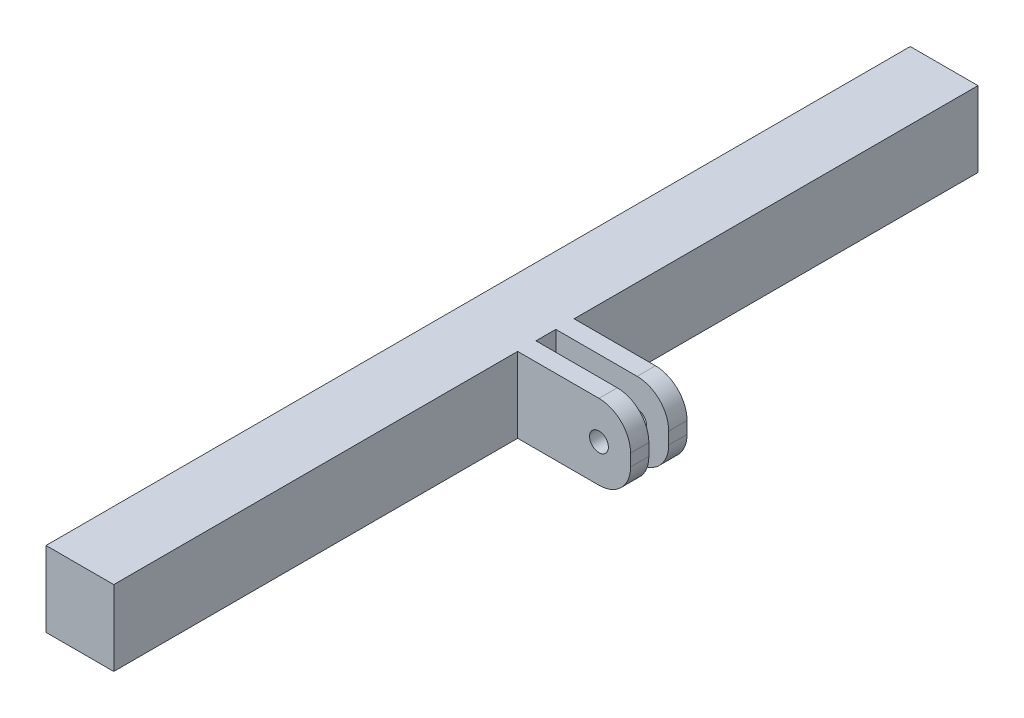
ISO-10303-21;
HEADER;
FILE_DESCRIPTION(('STEP AP214'),'2;1');
FILE_NAME('part.step','',(''),(''),'','','');
FILE_SCHEMA(('AUTOMOTIVE_DESIGN { 1 0 10303 214 1 1 1 1 }'));
ENDSEC;
DATA;
#1=APPLICATION_CONTEXT('core data for automotive mechanical design processes');
#2=APPLICATION_PROTOCOL_DEFINITION('international standard','automotive_design',2000,#1);
#3=PRODUCT_CONTEXT('',#1,'mechanical');
#4=PRODUCT('Part','Part','',(#3));
#5=PRODUCT_RELATED_PRODUCT_CATEGORY('part','',(#4));
#6=PRODUCT_DEFINITION_FORMATION('','',#4);
#7=PRODUCT_DEFINITION_CONTEXT('part definition',#1,'design');
#8=PRODUCT_DEFINITION('design','',#6,#7);
#9=PRODUCT_DEFINITION_SHAPE('','',#8);
#10=(LENGTH_UNIT() NAMED_UNIT(*) SI_UNIT(.MILLI.,.METRE.));
#11=(NAMED_UNIT(*) PLANE_ANGLE_UNIT() SI_UNIT($,.RADIAN.));
#12=(NAMED_UNIT(*) SI_UNIT($,.STERADIAN.) SOLID_ANGLE_UNIT());
#13=UNCERTAINTY_MEASURE_WITH_UNIT(LENGTH_MEASURE(1.E-05),#10,'distance_accuracy_value','');
#14=(GEOMETRIC_REPRESENTATION_CONTEXT(3) GLOBAL_UNCERTAINTY_ASSIGNED_CONTEXT((#13)) GLOBAL_UNIT_ASSIGNED_CONTEXT((#10,
#11,#12)) REPRESENTATION_CONTEXT('',''));
#15=CARTESIAN_POINT('',(0.,0.,0.));
#16=DIRECTION('',(0.,0.,1.));
#17=DIRECTION('',(1.,0.,0.));
#18=AXIS2_PLACEMENT_3D('',#15,#16,#17);
#19=CARTESIAN_POINT('',(25.146,-5.334,-4.7625));
#20=DIRECTION('',(0.,0.,1.));
#21=DIRECTION('',(1.,0.,0.));
#22=AXIS2_PLACEMENT_3D('',#19,#20,#21);
#23=CYLINDRICAL_SURFACE('',#22,5.334);
#24=DIRECTION('',(0.,0.,1.));
#25=VECTOR('',#24,1.);
#26=CARTESIAN_POINT('',(25.146,0.,-4.7625));
#27=LINE('',#26,#25);
#28=CARTESIAN_POINT('',(25.146,0.,-4.7625));
#29=VERTEX_POINT('',#28);
#30=CARTESIAN_POINT('',(25.146,0.,-1.6764));
#31=VERTEX_POINT('',#30);
#32=EDGE_CURVE('E214',#29,#31,#27,.T.);
#33=ORIENTED_EDGE('',*,*,#32,.T.);
#34=CARTESIAN_POINT('',(25.146,-5.334,-1.6764));
#35=DIRECTION('',(0.,0.,1.));
#36=DIRECTION('',(1.,0.,0.));
#37=AXIS2_PLACEMENT_3D('',#34,#35,#36);
#38=CIRCLE('',#37,5.334);
#39=CARTESIAN_POINT('',(30.48,-5.33400000000004,-1.6764));
#40=VERTEX_POINT('',#39);
#41=EDGE_CURVE('E161',#40,#31,#38,.T.);
#42=ORIENTED_EDGE('',*,*,#41,.F.);
#43=DIRECTION('',(0.,0.,1.));
#44=VECTOR('',#43,1.);
#45=CARTESIAN_POINT('',(30.48,-5.33400000000004,-4.7625));
#46=LINE('',#45,#44);
#47=CARTESIAN_POINT('',(30.48,-5.33400000000004,-4.7625));
#48=VERTEX_POINT('',#47);
#49=EDGE_CURVE('E218',#48,#40,#46,.T.);
#50=ORIENTED_EDGE('',*,*,#49,.F.);
#51=CARTESIAN_POINT('',(25.146,-5.334,-4.7625));
#52=DIRECTION('',(0.,0.,1.));
#53=DIRECTION('',(1.,0.,0.));
#54=AXIS2_PLACEMENT_3D('',#51,#52,#53);
#55=CIRCLE('',#54,5.334);
#56=EDGE_CURVE('E207',#48,#29,#55,.T.);
#57=ORIENTED_EDGE('',*,*,#56,.T.);
#58=EDGE_LOOP('',(#33,#42,#50,#57));
#59=FACE_BOUND('',#58,.T.);
#60=ADVANCED_FACE('F32',(#59),#23,.T.);
#61=CARTESIAN_POINT('',(30.48,-5.33400000000004,-4.7625));
#62=DIRECTION('',(1.,0.,0.));
#63=DIRECTION('',(0.,0.,-1.));
#64=AXIS2_PLACEMENT_3D('',#61,#62,#63);
#65=PLANE('',#64);
#66=ORIENTED_EDGE('',*,*,#49,.T.);
#67=DIRECTION('',(0.,1.,0.));
#68=VECTOR('',#67,1.);
#69=CARTESIAN_POINT('',(30.48,-7.366,-1.6764));
#70=LINE('',#69,#68);
#71=CARTESIAN_POINT('',(30.48,-7.366,-1.6764));
#72=VERTEX_POINT('',#71);
#73=EDGE_CURVE('E294',#72,#40,#70,.T.);
#74=ORIENTED_EDGE('',*,*,#73,.F.);
#75=DIRECTION('',(0.,0.,1.));
#76=VECTOR('',#75,1.);
#77=CARTESIAN_POINT('',(30.48,-7.36599999999996,-4.7625));
#78=LINE('',#77,#76);
#79=CARTESIAN_POINT('',(30.48,-7.36599999999996,-4.7625));
#80=VERTEX_POINT('',#79);
#81=EDGE_CURVE('E222',#80,#72,#78,.T.);
#82=ORIENTED_EDGE('',*,*,#81,.F.);
#83=DIRECTION('',(0.,1.,0.));
#84=VECTOR('',#83,1.);
#85=CARTESIAN_POINT('',(30.48,-5.33400000000004,-4.7625));
#86=LINE('',#85,#84);
#87=EDGE_CURVE('E204',#80,#48,#86,.T.);
#88=ORIENTED_EDGE('',*,*,#87,.T.);
#89=EDGE_LOOP('',(#66,#74,#82,#88));
#90=FACE_BOUND('',#89,.T.);
#91=ADVANCED_FACE('F292',(#90),#65,.T.);
#92=CARTESIAN_POINT('',(25.146,-7.366,-4.7625));
#93=DIRECTION('',(0.,0.,1.));
#94=DIRECTION('',(1.,0.,0.));
#95=AXIS2_PLACEMENT_3D('',#92,#93,#94);
#96=CYLINDRICAL_SURFACE('',#95,5.334);
#97=ORIENTED_EDGE('',*,*,#81,.T.);
#98=CARTESIAN_POINT('',(25.146,-7.366,-1.6764));
#99=DIRECTION('',(0.,0.,1.));
#100=DIRECTION('',(1.,0.,0.));
#101=AXIS2_PLACEMENT_3D('',#98,#99,#100);
#102=CIRCLE('',#101,5.334);
#103=CARTESIAN_POINT('',(25.146,-12.7,-1.6764));
#104=VERTEX_POINT('',#103);
#105=EDGE_CURVE('E287',#104,#72,#102,.T.);
#106=ORIENTED_EDGE('',*,*,#105,.F.);
#107=DIRECTION('',(0.,0.,1.));
#108=VECTOR('',#107,1.);
#109=CARTESIAN_POINT('',(25.146,-12.7,-4.7625));
#110=LINE('',#109,#108);
#111=CARTESIAN_POINT('',(25.146,-12.7,-4.7625));
#112=VERTEX_POINT('',#111);
#113=EDGE_CURVE('E226',#112,#104,#110,.T.);
#114=ORIENTED_EDGE('',*,*,#113,.F.);
#115=CARTESIAN_POINT('',(25.146,-7.366,-4.7625));
#116=DIRECTION('',(0.,0.,1.));
#117=DIRECTION('',(-1.,0.,0.));
#118=AXIS2_PLACEMENT_3D('',#115,#116,#117);
#119=CIRCLE('',#118,5.334);
#120=EDGE_CURVE('E201',#112,#80,#119,.T.);
#121=ORIENTED_EDGE('',*,*,#120,.T.);
#122=EDGE_LOOP('',(#97,#106,#114,#121));
#123=FACE_BOUND('',#122,.T.);
#124=ADVANCED_FACE('F286',(#123),#96,.T.);
#125=CARTESIAN_POINT('',(25.146,-6.35,-4.7625));
#126=DIRECTION('',(0.,0.,1.));
#127=DIRECTION('',(1.,0.,0.));
#128=AXIS2_PLACEMENT_3D('',#125,#126,#127);
#129=CYLINDRICAL_SURFACE('',#128,1.5875);
#130=CARTESIAN_POINT('',(25.146,-6.35,-4.7625));
#131=DIRECTION('',(0.,0.,1.));
#132=DIRECTION('',(1.,0.,0.));
#133=AXIS2_PLACEMENT_3D('',#130,#131,#132);
#134=CIRCLE('',#133,1.5875);
#135=CARTESIAN_POINT('',(26.7335,-6.35,-4.7625));
#136=VERTEX_POINT('',#135);
#137=EDGE_CURVE('E195',#136,#136,#134,.T.);
#138=ORIENTED_EDGE('',*,*,#137,.F.);
#139=EDGE_LOOP('',(#138));
#140=FACE_BOUND('',#139,.T.);
#141=CARTESIAN_POINT('',(25.146,-6.35,-1.6764));
#142=DIRECTION('',(0.,0.,1.));
#143=DIRECTION('',(1.,0.,0.));
#144=AXIS2_PLACEMENT_3D('',#141,#142,#143);
#145=CIRCLE('',#144,1.5875);
#146=CARTESIAN_POINT('',(26.7335,-6.35,-1.6764));
#147=VERTEX_POINT('',#146);
#148=EDGE_CURVE('E168',#147,#147,#145,.F.);
#149=ORIENTED_EDGE('',*,*,#148,.F.);
#150=EDGE_LOOP('',(#149));
#151=FACE_BOUND('',#150,.T.);
#152=ADVANCED_FACE('F337',(#140,#151),#129,.F.);
#153=CARTESIAN_POINT('',(11.43,0.,-72.898));
#154=DIRECTION('',(1.,0.,0.));
#155=DIRECTION('',(0.,0.,-1.));
#156=AXIS2_PLACEMENT_3D('',#153,#154,#155);
#157=PLANE('',#156);
#158=DIRECTION('',(0.,0.,1.));
#159=VECTOR('',#158,1.);
#160=CARTESIAN_POINT('',(11.43,0.,-72.898));
#161=LINE('',#160,#159);
#162=CARTESIAN_POINT('',(11.43,0.,-72.898));
#163=VERTEX_POINT('',#162);
#164=CARTESIAN_POINT('',(11.43,0.,-4.7625));
#165=VERTEX_POINT('',#164);
#166=EDGE_CURVE('E41',#163,#165,#161,.T.);
#167=ORIENTED_EDGE('',*,*,#166,.T.);
#168=DIRECTION('',(0.,-1.,0.));
#169=VECTOR('',#168,1.);
#170=CARTESIAN_POINT('',(11.43,0.,-4.7625));
#171=LINE('',#170,#169);
#172=CARTESIAN_POINT('',(11.43,-12.7,-4.7625));
#173=VERTEX_POINT('',#172);
#174=EDGE_CURVE('E198',#165,#173,#171,.T.);
#175=ORIENTED_EDGE('',*,*,#174,.T.);
#176=DIRECTION('',(0.,0.,1.));
#177=VECTOR('',#176,1.);
#178=CARTESIAN_POINT('',(11.43,-12.7,-72.898));
#179=LINE('',#178,#177);
#180=CARTESIAN_POINT('',(11.43,-12.7,-72.898));
#181=VERTEX_POINT('',#180);
#182=EDGE_CURVE('E256',#181,#173,#179,.T.);
#183=ORIENTED_EDGE('',*,*,#182,.F.);
#184=DIRECTION('',(0.,1.,0.));
#185=VECTOR('',#184,1.);
#186=CARTESIAN_POINT('',(11.43,0.,-72.898));
#187=LINE('',#186,#185);
#188=EDGE_CURVE('E246',#181,#163,#187,.T.);
#189=ORIENTED_EDGE('',*,*,#188,.T.);
#190=EDGE_LOOP('',(#167,#175,#183,#189));
#191=FACE_BOUND('',#190,.T.);
#192=ADVANCED_FACE('F284',(#191),#157,.T.);
#193=CARTESIAN_POINT('',(0.,0.,-72.898));
#194=DIRECTION('',(-1.,0.,0.));
#195=DIRECTION('',(0.,-1.,0.));
#196=AXIS2_PLACEMENT_3D('',#193,#194,#195);
#197=PLANE('',#196);
#198=DIRECTION('',(0.,0.,1.));
#199=VECTOR('',#198,1.);
#200=CARTESIAN_POINT('',(0.,-12.7,-72.898));
#201=LINE('',#200,#199);
#202=CARTESIAN_POINT('',(0.,-12.7,-72.898));
#203=VERTEX_POINT('',#202);
#204=CARTESIAN_POINT('',(0.,-12.7,72.898));
#205=VERTEX_POINT('',#204);
#206=EDGE_CURVE('E251',#203,#205,#201,.T.);
#207=ORIENTED_EDGE('',*,*,#206,.T.);
#208=DIRECTION('',(0.,-1.,0.));
#209=VECTOR('',#208,1.);
#210=CARTESIAN_POINT('',(0.,0.,72.898));
#211=LINE('',#210,#209);
#212=CARTESIAN_POINT('',(0.,0.,72.898));
#213=VERTEX_POINT('',#212);
#214=EDGE_CURVE('E216',#213,#205,#211,.T.);
#215=ORIENTED_EDGE('',*,*,#214,.F.);
#216=DIRECTION('',(0.,0.,1.));
#217=VECTOR('',#216,1.);
#218=CARTESIAN_POINT('',(0.,0.,-72.898));
#219=LINE('',#218,#217);
#220=CARTESIAN_POINT('',(0.,0.,-72.898));
#221=VERTEX_POINT('',#220);
#222=EDGE_CURVE('E11',#221,#213,#219,.T.);
#223=ORIENTED_EDGE('',*,*,#222,.F.);
#224=DIRECTION('',(0.,-1.,0.));
#225=VECTOR('',#224,1.);
#226=CARTESIAN_POINT('',(0.,0.,-72.898));
#227=LINE('',#226,#225);
#228=EDGE_CURVE('E240',#221,#203,#227,.T.);
#229=ORIENTED_EDGE('',*,*,#228,.T.);
#230=EDGE_LOOP('',(#207,#215,#223,#229));
#231=FACE_BOUND('',#230,.T.);
#232=ADVANCED_FACE('F34',(#231),#197,.T.);
#233=CARTESIAN_POINT('',(0.,0.,-72.898));
#234=DIRECTION('',(0.,1.,0.));
#235=DIRECTION('',(0.,0.,1.));
#236=AXIS2_PLACEMENT_3D('',#233,#234,#235);
#237=PLANE('',#236);
#238=DIRECTION('',(-1.,0.,0.));
#239=VECTOR('',#238,1.);
#240=CARTESIAN_POINT('',(25.146,0.,1.6764));
#241=LINE('',#240,#239);
#242=CARTESIAN_POINT('',(25.146,0.,1.6764));
#243=VERTEX_POINT('',#242);
#244=CARTESIAN_POINT('',(11.43,0.,1.6764));
#245=VERTEX_POINT('',#244);
#246=EDGE_CURVE('E167',#243,#245,#241,.T.);
#247=ORIENTED_EDGE('',*,*,#246,.T.);
#248=DIRECTION('',(0.,0.,-1.));
#249=VECTOR('',#248,1.);
#250=CARTESIAN_POINT('',(11.43,0.,1.6764));
#251=LINE('',#250,#249);
#252=CARTESIAN_POINT('',(11.43,0.,-1.6764));
#253=VERTEX_POINT('',#252);
#254=EDGE_CURVE('E151',#245,#253,#251,.T.);
#255=ORIENTED_EDGE('',*,*,#254,.T.);
#256=DIRECTION('',(-1.,0.,0.));
#257=VECTOR('',#256,1.);
#258=CARTESIAN_POINT('',(25.146,0.,-1.6764));
#259=LINE('',#258,#257);
#260=EDGE_CURVE('E155',#31,#253,#259,.T.);
#261=ORIENTED_EDGE('',*,*,#260,.F.);
#262=ORIENTED_EDGE('',*,*,#32,.F.);
#263=DIRECTION('',(-1.,0.,0.));
#264=VECTOR('',#263,1.);
#265=CARTESIAN_POINT('',(11.43,0.,-4.7625));
#266=LINE('',#265,#264);
#267=EDGE_CURVE('E210',#29,#165,#266,.T.);
#268=ORIENTED_EDGE('',*,*,#267,.T.);
#269=ORIENTED_EDGE('',*,*,#166,.F.);
#270=DIRECTION('',(-1.,0.,0.));
#271=VECTOR('',#270,1.);
#272=CARTESIAN_POINT('',(0.,0.,-72.898));
#273=LINE('',#272,#271);
#274=EDGE_CURVE('E249',#163,#221,#273,.T.);
#275=ORIENTED_EDGE('',*,*,#274,.T.);
#276=ORIENTED_EDGE('',*,*,#222,.T.);
#277=DIRECTION('',(-1.,0.,0.));
#278=VECTOR('',#277,1.);
#279=CARTESIAN_POINT('',(0.,0.,72.898));
#280=LINE('',#279,#278);
#281=CARTESIAN_POINT('',(11.43,0.,72.898));
#282=VERTEX_POINT('',#281);
#283=EDGE_CURVE('E237',#282,#213,#280,.T.);
#284=ORIENTED_EDGE('',*,*,#283,.F.);
#285=CARTESIAN_POINT('',(11.43,0.,4.7625));
#286=VERTEX_POINT('',#285);
#287=EDGE_CURVE('E255',#286,#282,#161,.T.);
#288=ORIENTED_EDGE('',*,*,#287,.F.);
#289=DIRECTION('',(-1.,0.,0.));
#290=VECTOR('',#289,1.);
#291=CARTESIAN_POINT('',(11.43,0.,4.7625));
#292=LINE('',#291,#290);
#293=CARTESIAN_POINT('',(25.146,0.,4.7625));
#294=VERTEX_POINT('',#293);
#295=EDGE_CURVE('E193',#294,#286,#292,.T.);
#296=ORIENTED_EDGE('',*,*,#295,.F.);
#297=EDGE_CURVE('E217',#243,#294,#27,.T.);
#298=ORIENTED_EDGE('',*,*,#297,.F.);
#299=EDGE_LOOP('',(#247,#255,#261,#262,#268,#269,#275,#276,#284,#288,#296,#298));
#300=FACE_BOUND('',#299,.T.);
#301=ADVANCED_FACE('F165',(#300),#237,.T.);
#302=DIRECTION('',(0.,-1.,0.));
#303=VECTOR('',#302,1.);
#304=CARTESIAN_POINT('',(11.43,0.,4.7625));
#305=LINE('',#304,#303);
#306=CARTESIAN_POINT('',(11.43,-12.7,4.7625));
#307=VERTEX_POINT('',#306);
#308=EDGE_CURVE('E178',#286,#307,#305,.T.);
#309=ORIENTED_EDGE('',*,*,#308,.F.);
#310=ORIENTED_EDGE('',*,*,#287,.T.);
#311=DIRECTION('',(0.,1.,0.));
#312=VECTOR('',#311,1.);
#313=CARTESIAN_POINT('',(11.43,0.,72.898));
#314=LINE('',#313,#312);
#315=CARTESIAN_POINT('',(11.43,-12.7,72.898));
#316=VERTEX_POINT('',#315);
#317=EDGE_CURVE('E234',#316,#282,#314,.T.);
#318=ORIENTED_EDGE('',*,*,#317,.F.);
#319=EDGE_CURVE('E259',#307,#316,#179,.T.);
#320=ORIENTED_EDGE('',*,*,#319,.F.);
#321=EDGE_LOOP('',(#309,#310,#318,#320));
#322=FACE_BOUND('',#321,.T.);
#323=ADVANCED_FACE('F273',(#322),#157,.T.);
#324=CARTESIAN_POINT('',(0.,-12.7,-72.898));
#325=DIRECTION('',(0.,-1.,0.));
#326=DIRECTION('',(0.,0.,-1.));
#327=AXIS2_PLACEMENT_3D('',#324,#325,#326);
#328=PLANE('',#327);
#329=DIRECTION('',(1.,0.,0.));
#330=VECTOR('',#329,1.);
#331=CARTESIAN_POINT('',(11.43,-12.7,1.6764));
#332=LINE('',#331,#330);
#333=CARTESIAN_POINT('',(11.43,-12.7,1.6764));
#334=VERTEX_POINT('',#333);
#335=CARTESIAN_POINT('',(25.146,-12.7,1.6764));
#336=VERTEX_POINT('',#335);
#337=EDGE_CURVE('E303',#334,#336,#332,.T.);
#338=ORIENTED_EDGE('',*,*,#337,.T.);
#339=CARTESIAN_POINT('',(25.146,-12.7,4.7625));
#340=VERTEX_POINT('',#339);
#341=EDGE_CURVE('E213',#336,#340,#110,.T.);
#342=ORIENTED_EDGE('',*,*,#341,.T.);
#343=DIRECTION('',(1.,0.,0.));
#344=VECTOR('',#343,1.);
#345=CARTESIAN_POINT('',(11.43,-12.7,4.7625));
#346=LINE('',#345,#344);
#347=EDGE_CURVE('E181',#307,#340,#346,.T.);
#348=ORIENTED_EDGE('',*,*,#347,.F.);
#349=ORIENTED_EDGE('',*,*,#319,.T.);
#350=DIRECTION('',(1.,0.,0.));
#351=VECTOR('',#350,1.);
#352=CARTESIAN_POINT('',(0.,-12.7,72.898));
#353=LINE('',#352,#351);
#354=EDGE_CURVE('E231',#205,#316,#353,.T.);
#355=ORIENTED_EDGE('',*,*,#354,.F.);
#356=ORIENTED_EDGE('',*,*,#206,.F.);
#357=DIRECTION('',(1.,0.,0.));
#358=VECTOR('',#357,1.);
#359=CARTESIAN_POINT('',(0.,-12.7,-72.898));
#360=LINE('',#359,#358);
#361=EDGE_CURVE('E243',#203,#181,#360,.T.);
#362=ORIENTED_EDGE('',*,*,#361,.T.);
#363=ORIENTED_EDGE('',*,*,#182,.T.);
#364=DIRECTION('',(1.,0.,0.));
#365=VECTOR('',#364,1.);
#366=CARTESIAN_POINT('',(11.43,-12.7,-4.7625));
#367=LINE('',#366,#365);
#368=EDGE_CURVE('E57',#173,#112,#367,.T.);
#369=ORIENTED_EDGE('',*,*,#368,.T.);
#370=ORIENTED_EDGE('',*,*,#113,.T.);
#371=DIRECTION('',(1.,0.,0.));
#372=VECTOR('',#371,1.);
#373=CARTESIAN_POINT('',(11.43,-12.7,-1.6764));
#374=LINE('',#373,#372);
#375=CARTESIAN_POINT('',(11.43,-12.7,-1.6764));
#376=VERTEX_POINT('',#375);
#377=EDGE_CURVE('E49',#376,#104,#374,.T.);
#378=ORIENTED_EDGE('',*,*,#377,.F.);
#379=DIRECTION('',(0.,0.,-1.));
#380=VECTOR('',#379,1.);
#381=CARTESIAN_POINT('',(11.43,-12.7,1.6764));
#382=LINE('',#381,#380);
#383=EDGE_CURVE('E154',#334,#376,#382,.T.);
#384=ORIENTED_EDGE('',*,*,#383,.F.);
#385=EDGE_LOOP('',(#338,#342,#348,#349,#355,#356,#362,#363,#369,#370,#378,#384));
#386=FACE_BOUND('',#385,.T.);
#387=ADVANCED_FACE('F266',(#386),#328,.T.);
#388=CARTESIAN_POINT('',(0.,0.,-72.898));
#389=DIRECTION('',(0.,0.,1.));
#390=DIRECTION('',(1.,0.,0.));
#391=AXIS2_PLACEMENT_3D('',#388,#389,#390);
#392=PLANE('',#391);
#393=ORIENTED_EDGE('',*,*,#228,.F.);
#394=ORIENTED_EDGE('',*,*,#274,.F.);
#395=ORIENTED_EDGE('',*,*,#188,.F.);
#396=ORIENTED_EDGE('',*,*,#361,.F.);
#397=EDGE_LOOP('',(#393,#394,#395,#396));
#398=FACE_BOUND('',#397,.T.);
#399=ADVANCED_FACE('F280',(#398),#392,.F.);
#400=CARTESIAN_POINT('',(0.,0.,72.898));
#401=DIRECTION('',(0.,0.,1.));
#402=DIRECTION('',(1.,0.,0.));
#403=AXIS2_PLACEMENT_3D('',#400,#401,#402);
#404=PLANE('',#403);
#405=ORIENTED_EDGE('',*,*,#214,.T.);
#406=ORIENTED_EDGE('',*,*,#354,.T.);
#407=ORIENTED_EDGE('',*,*,#317,.T.);
#408=ORIENTED_EDGE('',*,*,#283,.T.);
#409=EDGE_LOOP('',(#405,#406,#407,#408));
#410=FACE_BOUND('',#409,.T.);
#411=ADVANCED_FACE('F271',(#410),#404,.T.);
#412=CARTESIAN_POINT('',(25.146,-5.334,1.6764));
#413=DIRECTION('',(0.,0.,1.));
#414=DIRECTION('',(1.,0.,0.));
#415=AXIS2_PLACEMENT_3D('',#412,#413,#414);
#416=CIRCLE('',#415,5.334);
#417=CARTESIAN_POINT('',(30.48,-5.33400000000004,1.6764));
#418=VERTEX_POINT('',#417);
#419=EDGE_CURVE('E171',#418,#243,#416,.T.);
#420=ORIENTED_EDGE('',*,*,#419,.T.);
#421=ORIENTED_EDGE('',*,*,#297,.T.);
#422=CARTESIAN_POINT('',(25.146,-5.334,4.7625));
#423=DIRECTION('',(0.,0.,1.));
#424=DIRECTION('',(1.,0.,0.));
#425=AXIS2_PLACEMENT_3D('',#422,#423,#424);
#426=CIRCLE('',#425,5.334);
#427=CARTESIAN_POINT('',(30.48,-5.33400000000004,4.7625));
#428=VERTEX_POINT('',#427);
#429=EDGE_CURVE('E190',#428,#294,#426,.T.);
#430=ORIENTED_EDGE('',*,*,#429,.F.);
#431=EDGE_CURVE('E221',#418,#428,#46,.T.);
#432=ORIENTED_EDGE('',*,*,#431,.F.);
#433=EDGE_LOOP('',(#420,#421,#430,#432));
#434=FACE_BOUND('',#433,.T.);
#435=ADVANCED_FACE('F313',(#434),#23,.T.);
#436=DIRECTION('',(0.,1.,0.));
#437=VECTOR('',#436,1.);
#438=CARTESIAN_POINT('',(30.48,-7.366,1.6764));
#439=LINE('',#438,#437);
#440=CARTESIAN_POINT('',(30.48,-7.366,1.6764));
#441=VERTEX_POINT('',#440);
#442=EDGE_CURVE('E308',#441,#418,#439,.T.);
#443=ORIENTED_EDGE('',*,*,#442,.T.);
#444=ORIENTED_EDGE('',*,*,#431,.T.);
#445=DIRECTION('',(0.,1.,0.));
#446=VECTOR('',#445,1.);
#447=CARTESIAN_POINT('',(30.48,-5.33400000000004,4.7625));
#448=LINE('',#447,#446);
#449=CARTESIAN_POINT('',(30.48,-7.36599999999996,4.7625));
#450=VERTEX_POINT('',#449);
#451=EDGE_CURVE('E187',#450,#428,#448,.T.);
#452=ORIENTED_EDGE('',*,*,#451,.F.);
#453=EDGE_CURVE('E225',#441,#450,#78,.T.);
#454=ORIENTED_EDGE('',*,*,#453,.F.);
#455=EDGE_LOOP('',(#443,#444,#452,#454));
#456=FACE_BOUND('',#455,.T.);
#457=ADVANCED_FACE('F320',(#456),#65,.T.);
#458=CARTESIAN_POINT('',(25.146,-7.366,1.6764));
#459=DIRECTION('',(0.,0.,1.));
#460=DIRECTION('',(1.,0.,0.));
#461=AXIS2_PLACEMENT_3D('',#458,#459,#460);
#462=CIRCLE('',#461,5.334);
#463=EDGE_CURVE('E305',#336,#441,#462,.T.);
#464=ORIENTED_EDGE('',*,*,#463,.T.);
#465=ORIENTED_EDGE('',*,*,#453,.T.);
#466=CARTESIAN_POINT('',(25.146,-7.366,4.7625));
#467=DIRECTION('',(0.,0.,1.));
#468=DIRECTION('',(-1.,0.,0.));
#469=AXIS2_PLACEMENT_3D('',#466,#467,#468);
#470=CIRCLE('',#469,5.334);
#471=EDGE_CURVE('E184',#340,#450,#470,.T.);
#472=ORIENTED_EDGE('',*,*,#471,.F.);
#473=ORIENTED_EDGE('',*,*,#341,.F.);
#474=EDGE_LOOP('',(#464,#465,#472,#473));
#475=FACE_BOUND('',#474,.T.);
#476=ADVANCED_FACE('F324',(#475),#96,.T.);
#477=CARTESIAN_POINT('',(25.146,-7.366,-4.7625));
#478=DIRECTION('',(0.,0.,-1.));
#479=DIRECTION('',(-1.,0.,0.));
#480=AXIS2_PLACEMENT_3D('',#477,#478,#479);
#481=PLANE('',#480);
#482=ORIENTED_EDGE('',*,*,#137,.T.);
#483=EDGE_LOOP('',(#482));
#484=FACE_BOUND('',#483,.T.);
#485=ORIENTED_EDGE('',*,*,#174,.F.);
#486=ORIENTED_EDGE('',*,*,#267,.F.);
#487=ORIENTED_EDGE('',*,*,#56,.F.);
#488=ORIENTED_EDGE('',*,*,#87,.F.);
#489=ORIENTED_EDGE('',*,*,#120,.F.);
#490=ORIENTED_EDGE('',*,*,#368,.F.);
#491=EDGE_LOOP('',(#485,#486,#487,#488,#489,#490));
#492=FACE_BOUND('',#491,.T.);
#493=ADVANCED_FACE('F289',(#484,#492),#481,.T.);
#494=CARTESIAN_POINT('',(25.146,-6.35,1.6764));
#495=DIRECTION('',(0.,0.,1.));
#496=DIRECTION('',(1.,0.,0.));
#497=AXIS2_PLACEMENT_3D('',#494,#495,#496);
#498=CIRCLE('',#497,1.5875);
#499=CARTESIAN_POINT('',(26.7335,-6.35,1.6764));
#500=VERTEX_POINT('',#499);
#501=EDGE_CURVE('E36',#500,#500,#498,.F.);
#502=ORIENTED_EDGE('',*,*,#501,.T.);
#503=EDGE_LOOP('',(#502));
#504=FACE_BOUND('',#503,.T.);
#505=CARTESIAN_POINT('',(25.146,-6.35,4.7625));
#506=DIRECTION('',(0.,0.,1.));
#507=DIRECTION('',(1.,0.,0.));
#508=AXIS2_PLACEMENT_3D('',#505,#506,#507);
#509=CIRCLE('',#508,1.5875);
#510=CARTESIAN_POINT('',(26.7335,-6.35,4.7625));
#511=VERTEX_POINT('',#510);
#512=EDGE_CURVE('E175',#511,#511,#509,.T.);
#513=ORIENTED_EDGE('',*,*,#512,.T.);
#514=EDGE_LOOP('',(#513));
#515=FACE_BOUND('',#514,.T.);
#516=ADVANCED_FACE('F330',(#504,#515),#129,.F.);
#517=CARTESIAN_POINT('',(25.146,-7.366,4.7625));
#518=DIRECTION('',(0.,0.,-1.));
#519=DIRECTION('',(-1.,0.,0.));
#520=AXIS2_PLACEMENT_3D('',#517,#518,#519);
#521=PLANE('',#520);
#522=ORIENTED_EDGE('',*,*,#308,.T.);
#523=ORIENTED_EDGE('',*,*,#347,.T.);
#524=ORIENTED_EDGE('',*,*,#471,.T.);
#525=ORIENTED_EDGE('',*,*,#451,.T.);
#526=ORIENTED_EDGE('',*,*,#429,.T.);
#527=ORIENTED_EDGE('',*,*,#295,.T.);
#528=EDGE_LOOP('',(#522,#523,#524,#525,#526,#527));
#529=FACE_BOUND('',#528,.T.);
#530=ORIENTED_EDGE('',*,*,#512,.F.);
#531=EDGE_LOOP('',(#530));
#532=FACE_BOUND('',#531,.T.);
#533=ADVANCED_FACE('F327',(#529,#532),#521,.F.);
#534=CARTESIAN_POINT('',(25.146,-7.366,1.6764));
#535=DIRECTION('',(0.,0.,1.));
#536=DIRECTION('',(1.,0.,0.));
#537=AXIS2_PLACEMENT_3D('',#534,#535,#536);
#538=PLANE('',#537);
#539=ORIENTED_EDGE('',*,*,#246,.F.);
#540=ORIENTED_EDGE('',*,*,#419,.F.);
#541=ORIENTED_EDGE('',*,*,#442,.F.);
#542=ORIENTED_EDGE('',*,*,#463,.F.);
#543=ORIENTED_EDGE('',*,*,#337,.F.);
#544=DIRECTION('',(0.,-1.,0.));
#545=VECTOR('',#544,1.);
#546=CARTESIAN_POINT('',(11.43,0.,1.6764));
#547=LINE('',#546,#545);
#548=EDGE_CURVE('E301',#245,#334,#547,.T.);
#549=ORIENTED_EDGE('',*,*,#548,.F.);
#550=EDGE_LOOP('',(#539,#540,#541,#542,#543,#549));
#551=FACE_BOUND('',#550,.T.);
#552=ORIENTED_EDGE('',*,*,#501,.F.);
#553=EDGE_LOOP('',(#552));
#554=FACE_BOUND('',#553,.T.);
#555=ADVANCED_FACE('F316',(#551,#554),#538,.F.);
#556=CARTESIAN_POINT('',(25.146,-7.366,-1.6764));
#557=DIRECTION('',(0.,0.,1.));
#558=DIRECTION('',(1.,0.,0.));
#559=AXIS2_PLACEMENT_3D('',#556,#557,#558);
#560=PLANE('',#559);
#561=ORIENTED_EDGE('',*,*,#260,.T.);
#562=DIRECTION('',(0.,-1.,0.));
#563=VECTOR('',#562,1.);
#564=CARTESIAN_POINT('',(11.43,0.,-1.6764));
#565=LINE('',#564,#563);
#566=EDGE_CURVE('E147',#253,#376,#565,.T.);
#567=ORIENTED_EDGE('',*,*,#566,.T.);
#568=ORIENTED_EDGE('',*,*,#377,.T.);
#569=ORIENTED_EDGE('',*,*,#105,.T.);
#570=ORIENTED_EDGE('',*,*,#73,.T.);
#571=ORIENTED_EDGE('',*,*,#41,.T.);
#572=EDGE_LOOP('',(#561,#567,#568,#569,#570,#571));
#573=FACE_BOUND('',#572,.T.);
#574=ORIENTED_EDGE('',*,*,#148,.T.);
#575=EDGE_LOOP('',(#574));
#576=FACE_BOUND('',#575,.T.);
#577=ADVANCED_FACE('F158',(#573,#576),#560,.T.);
#578=CARTESIAN_POINT('',(11.43,0.,1.6764));
#579=DIRECTION('',(1.,0.,0.));
#580=DIRECTION('',(0.,1.,0.));
#581=AXIS2_PLACEMENT_3D('',#578,#579,#580);
#582=PLANE('',#581);
#583=ORIENTED_EDGE('',*,*,#254,.F.);
#584=ORIENTED_EDGE('',*,*,#548,.T.);
#585=ORIENTED_EDGE('',*,*,#383,.T.);
#586=ORIENTED_EDGE('',*,*,#566,.F.);
#587=EDGE_LOOP('',(#583,#584,#585,#586));
#588=FACE_BOUND('',#587,.T.);
#589=ADVANCED_FACE('F149',(#588),#582,.T.);
#590=CLOSED_SHELL('',(#60,#91,#124,#152,#192,#232,#301,#323,#387,#399,#411,#435,#457,#476,#493,
#516,#533,#555,#577,#589));
#591=MANIFOLD_SOLID_BREP('B2',#590);
#592=ADVANCED_BREP_SHAPE_REPRESENTATION('',(#18,#591),#14);
#593=SHAPE_DEFINITION_REPRESENTATION(#9,#592);
ENDSEC;
END-ISO-10303-21;
